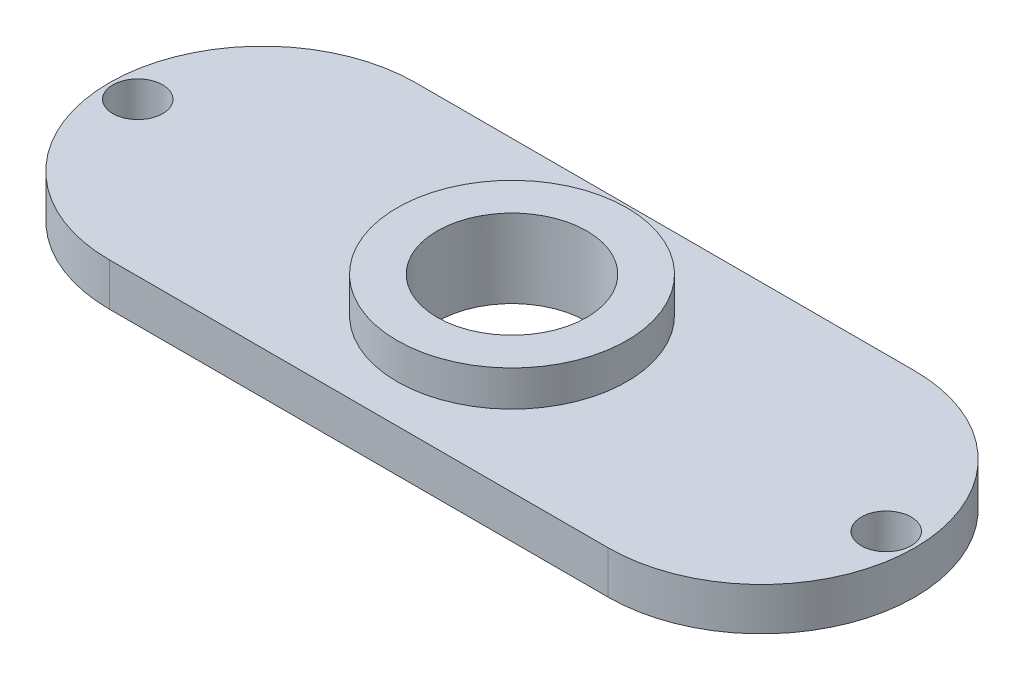
ISO-10303-21;
HEADER;
FILE_DESCRIPTION(('STEP AP214'),'2;1');
FILE_NAME('part.step','',(''),(''),'','','');
FILE_SCHEMA(('AUTOMOTIVE_DESIGN { 1 0 10303 214 1 1 1 1 }'));
ENDSEC;
DATA;
#1=APPLICATION_CONTEXT('core data for automotive mechanical design processes');
#2=APPLICATION_PROTOCOL_DEFINITION('international standard','automotive_design',2000,#1);
#3=PRODUCT_CONTEXT('',#1,'mechanical');
#4=PRODUCT('Part','Part','',(#3));
#5=PRODUCT_RELATED_PRODUCT_CATEGORY('part','',(#4));
#6=PRODUCT_DEFINITION_FORMATION('','',#4);
#7=PRODUCT_DEFINITION_CONTEXT('part definition',#1,'design');
#8=PRODUCT_DEFINITION('design','',#6,#7);
#9=PRODUCT_DEFINITION_SHAPE('','',#8);
#10=(LENGTH_UNIT() NAMED_UNIT(*) SI_UNIT(.MILLI.,.METRE.));
#11=(NAMED_UNIT(*) PLANE_ANGLE_UNIT() SI_UNIT($,.RADIAN.));
#12=(NAMED_UNIT(*) SI_UNIT($,.STERADIAN.) SOLID_ANGLE_UNIT());
#13=UNCERTAINTY_MEASURE_WITH_UNIT(LENGTH_MEASURE(1.E-05),#10,'distance_accuracy_value','');
#14=(GEOMETRIC_REPRESENTATION_CONTEXT(3) GLOBAL_UNCERTAINTY_ASSIGNED_CONTEXT((#13)) GLOBAL_UNIT_ASSIGNED_CONTEXT((#10,
#11,#12)) REPRESENTATION_CONTEXT('',''));
#15=CARTESIAN_POINT('',(0.,0.,0.));
#16=DIRECTION('',(0.,0.,1.));
#17=DIRECTION('',(1.,0.,0.));
#18=AXIS2_PLACEMENT_3D('',#15,#16,#17);
#19=CARTESIAN_POINT('',(0.,2.,0.));
#20=DIRECTION('',(0.,1.,0.));
#21=DIRECTION('',(0.,0.,1.));
#22=AXIS2_PLACEMENT_3D('',#19,#20,#21);
#23=PLANE('',#22);
#24=CARTESIAN_POINT('',(0.,2.,0.));
#25=DIRECTION('',(0.,1.,0.));
#26=DIRECTION('',(0.,0.,1.));
#27=AXIS2_PLACEMENT_3D('',#24,#25,#26);
#28=CIRCLE('',#27,6.45);
#29=CARTESIAN_POINT('',(0.,2.,6.45));
#30=VERTEX_POINT('',#29);
#31=EDGE_CURVE('E11',#30,#30,#28,.T.);
#32=ORIENTED_EDGE('',*,*,#31,.T.);
#33=EDGE_LOOP('',(#32));
#34=FACE_BOUND('',#33,.T.);
#35=CARTESIAN_POINT('',(0.,2.,0.));
#36=DIRECTION('',(0.,1.,0.));
#37=DIRECTION('',(0.,0.,1.));
#38=AXIS2_PLACEMENT_3D('',#35,#36,#37);
#39=CIRCLE('',#38,4.2);
#40=CARTESIAN_POINT('',(0.,2.,4.2));
#41=VERTEX_POINT('',#40);
#42=EDGE_CURVE('E53',#41,#41,#39,.T.);
#43=ORIENTED_EDGE('',*,*,#42,.F.);
#44=EDGE_LOOP('',(#43));
#45=FACE_BOUND('',#44,.T.);
#46=ADVANCED_FACE('F43',(#34,#45),#23,.T.);
#47=CARTESIAN_POINT('',(0.,2.,0.));
#48=DIRECTION('',(0.,-1.,0.));
#49=DIRECTION('',(0.,0.,-1.));
#50=AXIS2_PLACEMENT_3D('',#47,#48,#49);
#51=CYLINDRICAL_SURFACE('',#50,6.45);
#52=ORIENTED_EDGE('',*,*,#31,.F.);
#53=EDGE_LOOP('',(#52));
#54=FACE_BOUND('',#53,.T.);
#55=CARTESIAN_POINT('',(0.,0.,0.));
#56=DIRECTION('',(0.,1.,0.));
#57=DIRECTION('',(0.,0.,1.));
#58=AXIS2_PLACEMENT_3D('',#55,#56,#57);
#59=CIRCLE('',#58,6.45);
#60=CARTESIAN_POINT('',(0.,0.,6.45));
#61=VERTEX_POINT('',#60);
#62=EDGE_CURVE('E124',#61,#61,#59,.T.);
#63=ORIENTED_EDGE('',*,*,#62,.T.);
#64=EDGE_LOOP('',(#63));
#65=FACE_BOUND('',#64,.T.);
#66=ADVANCED_FACE('F45',(#54,#65),#51,.T.);
#67=CARTESIAN_POINT('',(0.,2.,0.));
#68=DIRECTION('',(0.,-1.,0.));
#69=DIRECTION('',(0.,0.,-1.));
#70=AXIS2_PLACEMENT_3D('',#67,#68,#69);
#71=CYLINDRICAL_SURFACE('',#70,4.2);
#72=ORIENTED_EDGE('',*,*,#42,.T.);
#73=EDGE_LOOP('',(#72));
#74=FACE_BOUND('',#73,.T.);
#75=CARTESIAN_POINT('',(0.,-2.4,0.));
#76=DIRECTION('',(0.,-1.,0.));
#77=DIRECTION('',(0.,0.,-1.));
#78=AXIS2_PLACEMENT_3D('',#75,#76,#77);
#79=CIRCLE('',#78,4.2);
#80=CARTESIAN_POINT('',(0.,-2.4,-4.2));
#81=VERTEX_POINT('',#80);
#82=EDGE_CURVE('E117',#81,#81,#79,.T.);
#83=ORIENTED_EDGE('',*,*,#82,.T.);
#84=EDGE_LOOP('',(#83));
#85=FACE_BOUND('',#84,.T.);
#86=ADVANCED_FACE('F177',(#74,#85),#71,.F.);
#87=CARTESIAN_POINT('',(-14.,-2.4,0.));
#88=DIRECTION('',(0.,-1.,0.));
#89=DIRECTION('',(0.,0.,-1.));
#90=AXIS2_PLACEMENT_3D('',#87,#88,#89);
#91=PLANE('',#90);
#92=CARTESIAN_POINT('',(21.,-2.4,0.));
#93=DIRECTION('',(0.,1.,0.));
#94=DIRECTION('',(0.,0.,-1.));
#95=AXIS2_PLACEMENT_3D('',#92,#93,#94);
#96=CIRCLE('',#95,1.4);
#97=CARTESIAN_POINT('',(21.,-2.4,-1.4));
#98=VERTEX_POINT('',#97);
#99=EDGE_CURVE('E140',#98,#98,#96,.T.);
#100=ORIENTED_EDGE('',*,*,#99,.T.);
#101=EDGE_LOOP('',(#100));
#102=FACE_BOUND('',#101,.T.);
#103=CARTESIAN_POINT('',(-21.,-2.4,0.));
#104=DIRECTION('',(0.,-1.,0.));
#105=DIRECTION('',(0.,0.,-1.));
#106=AXIS2_PLACEMENT_3D('',#103,#104,#105);
#107=CIRCLE('',#106,1.4);
#108=CARTESIAN_POINT('',(-21.,-2.4,-1.4));
#109=VERTEX_POINT('',#108);
#110=EDGE_CURVE('E130',#109,#109,#107,.T.);
#111=ORIENTED_EDGE('',*,*,#110,.F.);
#112=EDGE_LOOP('',(#111));
#113=FACE_BOUND('',#112,.T.);
#114=CARTESIAN_POINT('',(-14.,-2.4,0.));
#115=DIRECTION('',(0.,-1.,0.));
#116=DIRECTION('',(0.,0.,-1.));
#117=AXIS2_PLACEMENT_3D('',#114,#115,#116);
#118=CIRCLE('',#117,8.6);
#119=CARTESIAN_POINT('',(-14.,-2.4,8.6));
#120=VERTEX_POINT('',#119);
#121=CARTESIAN_POINT('',(-14.,-2.4,-8.6));
#122=VERTEX_POINT('',#121);
#123=EDGE_CURVE('E99',#120,#122,#118,.T.);
#124=ORIENTED_EDGE('',*,*,#123,.T.);
#125=DIRECTION('',(1.,0.,0.));
#126=VECTOR('',#125,1.);
#127=CARTESIAN_POINT('',(-14.,-2.4,-8.6));
#128=LINE('',#127,#126);
#129=CARTESIAN_POINT('',(14.,-2.4,-8.59999999999999));
#130=VERTEX_POINT('',#129);
#131=EDGE_CURVE('E93',#122,#130,#128,.T.);
#132=ORIENTED_EDGE('',*,*,#131,.T.);
#133=CARTESIAN_POINT('',(14.,-2.4,0.));
#134=DIRECTION('',(0.,-1.,0.));
#135=DIRECTION('',(0.,0.,-1.));
#136=AXIS2_PLACEMENT_3D('',#133,#134,#135);
#137=CIRCLE('',#136,8.6);
#138=CARTESIAN_POINT('',(14.,-2.4,8.6));
#139=VERTEX_POINT('',#138);
#140=EDGE_CURVE('E97',#130,#139,#137,.T.);
#141=ORIENTED_EDGE('',*,*,#140,.T.);
#142=DIRECTION('',(-1.,0.,0.));
#143=VECTOR('',#142,1.);
#144=CARTESIAN_POINT('',(-14.,-2.4,8.6));
#145=LINE('',#144,#143);
#146=EDGE_CURVE('E62',#139,#120,#145,.T.);
#147=ORIENTED_EDGE('',*,*,#146,.T.);
#148=EDGE_LOOP('',(#124,#132,#141,#147));
#149=FACE_BOUND('',#148,.T.);
#150=ORIENTED_EDGE('',*,*,#82,.F.);
#151=EDGE_LOOP('',(#150));
#152=FACE_BOUND('',#151,.T.);
#153=ADVANCED_FACE('F94',(#102,#113,#149,#152),#91,.T.);
#154=CARTESIAN_POINT('',(-14.,0.,0.));
#155=DIRECTION('',(0.,-1.,0.));
#156=DIRECTION('',(0.,0.,-1.));
#157=AXIS2_PLACEMENT_3D('',#154,#155,#156);
#158=PLANE('',#157);
#159=CARTESIAN_POINT('',(21.,0.,0.));
#160=DIRECTION('',(0.,-1.,0.));
#161=DIRECTION('',(0.,0.,-1.));
#162=AXIS2_PLACEMENT_3D('',#159,#160,#161);
#163=CIRCLE('',#162,1.4);
#164=CARTESIAN_POINT('',(21.,0.,-1.4));
#165=VERTEX_POINT('',#164);
#166=EDGE_CURVE('E47',#165,#165,#163,.F.);
#167=ORIENTED_EDGE('',*,*,#166,.F.);
#168=EDGE_LOOP('',(#167));
#169=FACE_BOUND('',#168,.T.);
#170=CARTESIAN_POINT('',(-21.,0.,0.));
#171=DIRECTION('',(0.,-1.,0.));
#172=DIRECTION('',(0.,0.,-1.));
#173=AXIS2_PLACEMENT_3D('',#170,#171,#172);
#174=CIRCLE('',#173,1.4);
#175=CARTESIAN_POINT('',(-21.,0.,-1.4));
#176=VERTEX_POINT('',#175);
#177=EDGE_CURVE('E128',#176,#176,#174,.T.);
#178=ORIENTED_EDGE('',*,*,#177,.T.);
#179=EDGE_LOOP('',(#178));
#180=FACE_BOUND('',#179,.T.);
#181=ORIENTED_EDGE('',*,*,#62,.F.);
#182=EDGE_LOOP('',(#181));
#183=FACE_BOUND('',#182,.T.);
#184=CARTESIAN_POINT('',(-14.,0.,0.));
#185=DIRECTION('',(0.,-1.,0.));
#186=DIRECTION('',(0.,0.,-1.));
#187=AXIS2_PLACEMENT_3D('',#184,#185,#186);
#188=CIRCLE('',#187,8.6);
#189=CARTESIAN_POINT('',(-14.,0.,8.6));
#190=VERTEX_POINT('',#189);
#191=CARTESIAN_POINT('',(-14.,0.,-8.6));
#192=VERTEX_POINT('',#191);
#193=EDGE_CURVE('E114',#190,#192,#188,.T.);
#194=ORIENTED_EDGE('',*,*,#193,.F.);
#195=DIRECTION('',(-1.,0.,0.));
#196=VECTOR('',#195,1.);
#197=CARTESIAN_POINT('',(-14.,0.,8.6));
#198=LINE('',#197,#196);
#199=CARTESIAN_POINT('',(14.,0.,8.6));
#200=VERTEX_POINT('',#199);
#201=EDGE_CURVE('E85',#200,#190,#198,.T.);
#202=ORIENTED_EDGE('',*,*,#201,.F.);
#203=CARTESIAN_POINT('',(14.,0.,0.));
#204=DIRECTION('',(0.,-1.,0.));
#205=DIRECTION('',(0.,0.,-1.));
#206=AXIS2_PLACEMENT_3D('',#203,#204,#205);
#207=CIRCLE('',#206,8.6);
#208=CARTESIAN_POINT('',(14.,0.,-8.59999999999999));
#209=VERTEX_POINT('',#208);
#210=EDGE_CURVE('E79',#209,#200,#207,.T.);
#211=ORIENTED_EDGE('',*,*,#210,.F.);
#212=DIRECTION('',(1.,0.,0.));
#213=VECTOR('',#212,1.);
#214=CARTESIAN_POINT('',(-14.,0.,-8.6));
#215=LINE('',#214,#213);
#216=EDGE_CURVE('E104',#192,#209,#215,.T.);
#217=ORIENTED_EDGE('',*,*,#216,.F.);
#218=EDGE_LOOP('',(#194,#202,#211,#217));
#219=FACE_BOUND('',#218,.T.);
#220=ADVANCED_FACE('F154',(#169,#180,#183,#219),#158,.F.);
#221=CARTESIAN_POINT('',(-14.,-2.4,0.));
#222=DIRECTION('',(0.,1.,0.));
#223=DIRECTION('',(0.,0.,1.));
#224=AXIS2_PLACEMENT_3D('',#221,#222,#223);
#225=CYLINDRICAL_SURFACE('',#224,8.6);
#226=ORIENTED_EDGE('',*,*,#193,.T.);
#227=DIRECTION('',(0.,1.,0.));
#228=VECTOR('',#227,1.);
#229=CARTESIAN_POINT('',(-14.,-2.4,-8.6));
#230=LINE('',#229,#228);
#231=EDGE_CURVE('E105',#122,#192,#230,.T.);
#232=ORIENTED_EDGE('',*,*,#231,.F.);
#233=ORIENTED_EDGE('',*,*,#123,.F.);
#234=DIRECTION('',(0.,1.,0.));
#235=VECTOR('',#234,1.);
#236=CARTESIAN_POINT('',(-14.,-2.4,8.6));
#237=LINE('',#236,#235);
#238=EDGE_CURVE('E110',#120,#190,#237,.T.);
#239=ORIENTED_EDGE('',*,*,#238,.T.);
#240=EDGE_LOOP('',(#226,#232,#233,#239));
#241=FACE_BOUND('',#240,.T.);
#242=ADVANCED_FACE('F156',(#241),#225,.T.);
#243=CARTESIAN_POINT('',(-14.,-2.4,-8.6));
#244=DIRECTION('',(0.,0.,1.));
#245=DIRECTION('',(1.,0.,0.));
#246=AXIS2_PLACEMENT_3D('',#243,#244,#245);
#247=PLANE('',#246);
#248=ORIENTED_EDGE('',*,*,#216,.T.);
#249=DIRECTION('',(0.,1.,0.));
#250=VECTOR('',#249,1.);
#251=CARTESIAN_POINT('',(14.,-2.4,-8.59999999999999));
#252=LINE('',#251,#250);
#253=EDGE_CURVE('E102',#130,#209,#252,.T.);
#254=ORIENTED_EDGE('',*,*,#253,.F.);
#255=ORIENTED_EDGE('',*,*,#131,.F.);
#256=ORIENTED_EDGE('',*,*,#231,.T.);
#257=EDGE_LOOP('',(#248,#254,#255,#256));
#258=FACE_BOUND('',#257,.T.);
#259=ADVANCED_FACE('F103',(#258),#247,.F.);
#260=CARTESIAN_POINT('',(14.,-2.4,0.));
#261=DIRECTION('',(0.,1.,0.));
#262=DIRECTION('',(0.,0.,1.));
#263=AXIS2_PLACEMENT_3D('',#260,#261,#262);
#264=CYLINDRICAL_SURFACE('',#263,8.6);
#265=ORIENTED_EDGE('',*,*,#210,.T.);
#266=DIRECTION('',(0.,1.,0.));
#267=VECTOR('',#266,1.);
#268=CARTESIAN_POINT('',(14.,-2.4,8.6));
#269=LINE('',#268,#267);
#270=EDGE_CURVE('E106',#139,#200,#269,.T.);
#271=ORIENTED_EDGE('',*,*,#270,.F.);
#272=ORIENTED_EDGE('',*,*,#140,.F.);
#273=ORIENTED_EDGE('',*,*,#253,.T.);
#274=EDGE_LOOP('',(#265,#271,#272,#273));
#275=FACE_BOUND('',#274,.T.);
#276=ADVANCED_FACE('F108',(#275),#264,.T.);
#277=CARTESIAN_POINT('',(-14.,-2.4,8.6));
#278=DIRECTION('',(0.,0.,-1.));
#279=DIRECTION('',(-1.,0.,0.));
#280=AXIS2_PLACEMENT_3D('',#277,#278,#279);
#281=PLANE('',#280);
#282=ORIENTED_EDGE('',*,*,#201,.T.);
#283=ORIENTED_EDGE('',*,*,#238,.F.);
#284=ORIENTED_EDGE('',*,*,#146,.F.);
#285=ORIENTED_EDGE('',*,*,#270,.T.);
#286=EDGE_LOOP('',(#282,#283,#284,#285));
#287=FACE_BOUND('',#286,.T.);
#288=ADVANCED_FACE('F163',(#287),#281,.F.);
#289=CARTESIAN_POINT('',(-21.,7.6,0.));
#290=DIRECTION('',(0.,-1.,0.));
#291=DIRECTION('',(0.,0.,-1.));
#292=AXIS2_PLACEMENT_3D('',#289,#290,#291);
#293=CYLINDRICAL_SURFACE('',#292,1.4);
#294=ORIENTED_EDGE('',*,*,#110,.T.);
#295=EDGE_LOOP('',(#294));
#296=FACE_BOUND('',#295,.T.);
#297=ORIENTED_EDGE('',*,*,#177,.F.);
#298=EDGE_LOOP('',(#297));
#299=FACE_BOUND('',#298,.T.);
#300=ADVANCED_FACE('F150',(#296,#299),#293,.F.);
#301=CARTESIAN_POINT('',(21.,7.6,0.));
#302=DIRECTION('',(0.,-1.,0.));
#303=DIRECTION('',(0.,0.,-1.));
#304=AXIS2_PLACEMENT_3D('',#301,#302,#303);
#305=CYLINDRICAL_SURFACE('',#304,1.4);
#306=ORIENTED_EDGE('',*,*,#99,.F.);
#307=EDGE_LOOP('',(#306));
#308=FACE_BOUND('',#307,.T.);
#309=ORIENTED_EDGE('',*,*,#166,.T.);
#310=EDGE_LOOP('',(#309));
#311=FACE_BOUND('',#310,.T.);
#312=ADVANCED_FACE('F147',(#308,#311),#305,.F.);
#313=CLOSED_SHELL('',(#46,#66,#86,#153,#220,#242,#259,#276,#288,#300,#312));
#314=MANIFOLD_SOLID_BREP('B2',#313);
#315=ADVANCED_BREP_SHAPE_REPRESENTATION('',(#18,#314),#14);
#316=SHAPE_DEFINITION_REPRESENTATION(#9,#315);
ENDSEC;
END-ISO-10303-21;
